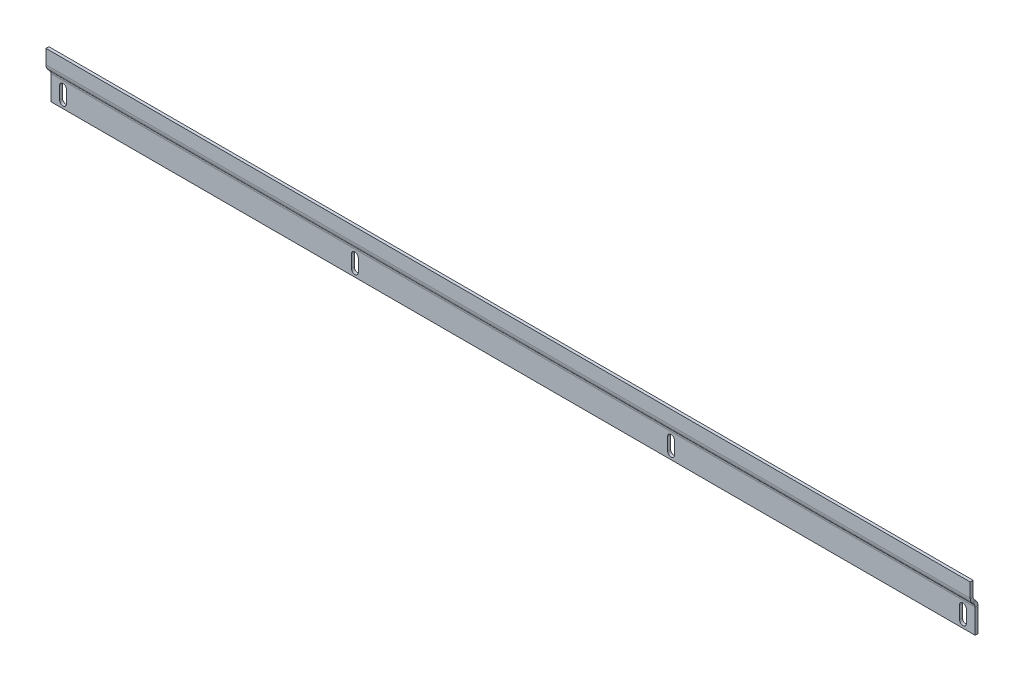
ISO-10303-21;
HEADER;
FILE_DESCRIPTION(('STEP AP214'),'2;1');
FILE_NAME('part.step','',(''),(''),'','','');
FILE_SCHEMA(('AUTOMOTIVE_DESIGN { 1 0 10303 214 1 1 1 1 }'));
ENDSEC;
DATA;
#1=APPLICATION_CONTEXT('core data for automotive mechanical design processes');
#2=APPLICATION_PROTOCOL_DEFINITION('international standard','automotive_design',2000,#1);
#3=PRODUCT_CONTEXT('',#1,'mechanical');
#4=PRODUCT('Part','Part','',(#3));
#5=PRODUCT_RELATED_PRODUCT_CATEGORY('part','',(#4));
#6=PRODUCT_DEFINITION_FORMATION('','',#4);
#7=PRODUCT_DEFINITION_CONTEXT('part definition',#1,'design');
#8=PRODUCT_DEFINITION('design','',#6,#7);
#9=PRODUCT_DEFINITION_SHAPE('','',#8);
#10=(LENGTH_UNIT() NAMED_UNIT(*) SI_UNIT(.MILLI.,.METRE.));
#11=(NAMED_UNIT(*) PLANE_ANGLE_UNIT() SI_UNIT($,.RADIAN.));
#12=(NAMED_UNIT(*) SI_UNIT($,.STERADIAN.) SOLID_ANGLE_UNIT());
#13=UNCERTAINTY_MEASURE_WITH_UNIT(LENGTH_MEASURE(1.E-05),#10,'distance_accuracy_value','');
#14=(GEOMETRIC_REPRESENTATION_CONTEXT(3) GLOBAL_UNCERTAINTY_ASSIGNED_CONTEXT((#13)) GLOBAL_UNIT_ASSIGNED_CONTEXT((#10,
#11,#12)) REPRESENTATION_CONTEXT('',''));
#15=CARTESIAN_POINT('',(0.,0.,0.));
#16=DIRECTION('',(0.,0.,1.));
#17=DIRECTION('',(1.,0.,0.));
#18=AXIS2_PLACEMENT_3D('',#15,#16,#17);
#19=CARTESIAN_POINT('',(-466.,-19.,0.));
#20=DIRECTION('',(1.,0.,0.));
#21=DIRECTION('',(0.,-1.,0.));
#22=AXIS2_PLACEMENT_3D('',#19,#20,#21);
#23=PLANE('',#22);
#24=DIRECTION('',(0.,0.,1.));
#25=VECTOR('',#24,1.);
#26=CARTESIAN_POINT('',(-466.,-19.,0.));
#27=LINE('',#26,#25);
#28=CARTESIAN_POINT('',(-466.,-19.,-3.));
#29=VERTEX_POINT('',#28);
#30=CARTESIAN_POINT('',(-466.,-19.,0.));
#31=VERTEX_POINT('',#30);
#32=EDGE_CURVE('E11',#29,#31,#27,.T.);
#33=ORIENTED_EDGE('',*,*,#32,.F.);
#34=DIRECTION('',(0.,1.,0.));
#35=VECTOR('',#34,1.);
#36=CARTESIAN_POINT('',(-466.,0.,-3.));
#37=LINE('',#36,#35);
#38=CARTESIAN_POINT('',(-466.,-6.00000000000002,-3.));
#39=VERTEX_POINT('',#38);
#40=EDGE_CURVE('E174',#39,#29,#37,.F.);
#41=ORIENTED_EDGE('',*,*,#40,.F.);
#42=DIRECTION('',(0.,0.,1.));
#43=VECTOR('',#42,1.);
#44=CARTESIAN_POINT('',(-466.,-6.00000000000002,0.));
#45=LINE('',#44,#43);
#46=CARTESIAN_POINT('',(-466.,-6.00000000000002,0.));
#47=VERTEX_POINT('',#46);
#48=EDGE_CURVE('E53',#39,#47,#45,.T.);
#49=ORIENTED_EDGE('',*,*,#48,.T.);
#50=DIRECTION('',(0.,-1.,0.));
#51=VECTOR('',#50,1.);
#52=CARTESIAN_POINT('',(-466.,-19.,0.));
#53=LINE('',#52,#51);
#54=EDGE_CURVE('E271',#47,#31,#53,.T.);
#55=ORIENTED_EDGE('',*,*,#54,.T.);
#56=EDGE_LOOP('',(#33,#41,#49,#55));
#57=FACE_BOUND('',#56,.T.);
#58=ADVANCED_FACE('F43',(#57),#23,.T.);
#59=CARTESIAN_POINT('',(-462.5,-6.00000000000002,0.));
#60=DIRECTION('',(0.,0.,-1.));
#61=DIRECTION('',(-1.,0.,0.));
#62=AXIS2_PLACEMENT_3D('',#59,#60,#61);
#63=CYLINDRICAL_SURFACE('',#62,3.5);
#64=ORIENTED_EDGE('',*,*,#48,.F.);
#65=CARTESIAN_POINT('',(-462.5,-6.00000000000002,-3.));
#66=DIRECTION('',(0.,0.,1.));
#67=DIRECTION('',(1.,0.,0.));
#68=AXIS2_PLACEMENT_3D('',#65,#66,#67);
#69=CIRCLE('',#68,3.5);
#70=CARTESIAN_POINT('',(-459.,-6.00000000000002,-3.));
#71=VERTEX_POINT('',#70);
#72=EDGE_CURVE('E191',#71,#39,#69,.T.);
#73=ORIENTED_EDGE('',*,*,#72,.F.);
#74=DIRECTION('',(0.,0.,1.));
#75=VECTOR('',#74,1.);
#76=CARTESIAN_POINT('',(-459.,-6.00000000000002,0.));
#77=LINE('',#76,#75);
#78=CARTESIAN_POINT('',(-459.,-6.00000000000002,0.));
#79=VERTEX_POINT('',#78);
#80=EDGE_CURVE('E165',#71,#79,#77,.T.);
#81=ORIENTED_EDGE('',*,*,#80,.T.);
#82=CARTESIAN_POINT('',(-462.5,-6.00000000000002,0.));
#83=DIRECTION('',(0.,0.,1.));
#84=DIRECTION('',(1.,0.,0.));
#85=AXIS2_PLACEMENT_3D('',#82,#83,#84);
#86=CIRCLE('',#85,3.5);
#87=EDGE_CURVE('E280',#79,#47,#86,.T.);
#88=ORIENTED_EDGE('',*,*,#87,.T.);
#89=EDGE_LOOP('',(#64,#73,#81,#88));
#90=FACE_BOUND('',#89,.T.);
#91=ADVANCED_FACE('F283',(#90),#63,.F.);
#92=CARTESIAN_POINT('',(-459.,-19.,0.));
#93=DIRECTION('',(-1.,0.,0.));
#94=DIRECTION('',(0.,1.,0.));
#95=AXIS2_PLACEMENT_3D('',#92,#93,#94);
#96=PLANE('',#95);
#97=ORIENTED_EDGE('',*,*,#80,.F.);
#98=DIRECTION('',(0.,1.,0.));
#99=VECTOR('',#98,1.);
#100=CARTESIAN_POINT('',(-459.,0.,-3.));
#101=LINE('',#100,#99);
#102=CARTESIAN_POINT('',(-459.,-19.,-3.));
#103=VERTEX_POINT('',#102);
#104=EDGE_CURVE('E172',#103,#71,#101,.T.);
#105=ORIENTED_EDGE('',*,*,#104,.F.);
#106=DIRECTION('',(0.,0.,1.));
#107=VECTOR('',#106,1.);
#108=CARTESIAN_POINT('',(-459.,-19.,0.));
#109=LINE('',#108,#107);
#110=CARTESIAN_POINT('',(-459.,-19.,0.));
#111=VERTEX_POINT('',#110);
#112=EDGE_CURVE('E47',#103,#111,#109,.T.);
#113=ORIENTED_EDGE('',*,*,#112,.T.);
#114=DIRECTION('',(0.,1.,0.));
#115=VECTOR('',#114,1.);
#116=CARTESIAN_POINT('',(-459.,-19.,0.));
#117=LINE('',#116,#115);
#118=EDGE_CURVE('E563',#111,#79,#117,.T.);
#119=ORIENTED_EDGE('',*,*,#118,.T.);
#120=EDGE_LOOP('',(#97,#105,#113,#119));
#121=FACE_BOUND('',#120,.T.);
#122=ADVANCED_FACE('F177',(#121),#96,.T.);
#123=CARTESIAN_POINT('',(459.,-19.,0.));
#124=DIRECTION('',(1.,0.,0.));
#125=DIRECTION('',(0.,-1.,0.));
#126=AXIS2_PLACEMENT_3D('',#123,#124,#125);
#127=PLANE('',#126);
#128=DIRECTION('',(0.,0.,1.));
#129=VECTOR('',#128,1.);
#130=CARTESIAN_POINT('',(459.,-19.,0.));
#131=LINE('',#130,#129);
#132=CARTESIAN_POINT('',(459.,-19.,-3.));
#133=VERTEX_POINT('',#132);
#134=CARTESIAN_POINT('',(459.,-19.,0.));
#135=VERTEX_POINT('',#134);
#136=EDGE_CURVE('E166',#133,#135,#131,.T.);
#137=ORIENTED_EDGE('',*,*,#136,.F.);
#138=DIRECTION('',(0.,1.,0.));
#139=VECTOR('',#138,1.);
#140=CARTESIAN_POINT('',(459.,0.,-3.));
#141=LINE('',#140,#139);
#142=CARTESIAN_POINT('',(459.,-6.00000000000002,-3.));
#143=VERTEX_POINT('',#142);
#144=EDGE_CURVE('E185',#143,#133,#141,.F.);
#145=ORIENTED_EDGE('',*,*,#144,.F.);
#146=DIRECTION('',(0.,0.,1.));
#147=VECTOR('',#146,1.);
#148=CARTESIAN_POINT('',(459.,-6.00000000000002,0.));
#149=LINE('',#148,#147);
#150=CARTESIAN_POINT('',(459.,-6.00000000000002,0.));
#151=VERTEX_POINT('',#150);
#152=EDGE_CURVE('E259',#143,#151,#149,.T.);
#153=ORIENTED_EDGE('',*,*,#152,.T.);
#154=DIRECTION('',(0.,-1.,0.));
#155=VECTOR('',#154,1.);
#156=CARTESIAN_POINT('',(459.,-19.,0.));
#157=LINE('',#156,#155);
#158=EDGE_CURVE('E557',#151,#135,#157,.T.);
#159=ORIENTED_EDGE('',*,*,#158,.T.);
#160=EDGE_LOOP('',(#137,#145,#153,#159));
#161=FACE_BOUND('',#160,.T.);
#162=ADVANCED_FACE('F586',(#161),#127,.T.);
#163=CARTESIAN_POINT('',(462.5,-6.00000000000002,0.));
#164=DIRECTION('',(0.,0.,-1.));
#165=DIRECTION('',(-1.,0.,0.));
#166=AXIS2_PLACEMENT_3D('',#163,#164,#165);
#167=CYLINDRICAL_SURFACE('',#166,3.5);
#168=ORIENTED_EDGE('',*,*,#152,.F.);
#169=CARTESIAN_POINT('',(462.5,-6.00000000000002,-3.));
#170=DIRECTION('',(0.,0.,1.));
#171=DIRECTION('',(1.,0.,0.));
#172=AXIS2_PLACEMENT_3D('',#169,#170,#171);
#173=CIRCLE('',#172,3.5);
#174=CARTESIAN_POINT('',(466.,-6.00000000000002,-3.));
#175=VERTEX_POINT('',#174);
#176=EDGE_CURVE('E180',#175,#143,#173,.T.);
#177=ORIENTED_EDGE('',*,*,#176,.F.);
#178=DIRECTION('',(0.,0.,1.));
#179=VECTOR('',#178,1.);
#180=CARTESIAN_POINT('',(466.,-6.00000000000002,0.));
#181=LINE('',#180,#179);
#182=CARTESIAN_POINT('',(466.,-6.00000000000002,0.));
#183=VERTEX_POINT('',#182);
#184=EDGE_CURVE('E256',#175,#183,#181,.T.);
#185=ORIENTED_EDGE('',*,*,#184,.T.);
#186=CARTESIAN_POINT('',(462.5,-6.00000000000002,0.));
#187=DIRECTION('',(0.,0.,1.));
#188=DIRECTION('',(1.,0.,0.));
#189=AXIS2_PLACEMENT_3D('',#186,#187,#188);
#190=CIRCLE('',#189,3.5);
#191=EDGE_CURVE('E457',#183,#151,#190,.T.);
#192=ORIENTED_EDGE('',*,*,#191,.T.);
#193=EDGE_LOOP('',(#168,#177,#185,#192));
#194=FACE_BOUND('',#193,.T.);
#195=ADVANCED_FACE('F455',(#194),#167,.F.);
#196=CARTESIAN_POINT('',(466.,-19.,0.));
#197=DIRECTION('',(-1.,0.,0.));
#198=DIRECTION('',(0.,1.,0.));
#199=AXIS2_PLACEMENT_3D('',#196,#197,#198);
#200=PLANE('',#199);
#201=ORIENTED_EDGE('',*,*,#184,.F.);
#202=DIRECTION('',(0.,1.,0.));
#203=VECTOR('',#202,1.);
#204=CARTESIAN_POINT('',(466.,0.,-3.));
#205=LINE('',#204,#203);
#206=CARTESIAN_POINT('',(466.,-19.,-3.));
#207=VERTEX_POINT('',#206);
#208=EDGE_CURVE('E423',#207,#175,#205,.T.);
#209=ORIENTED_EDGE('',*,*,#208,.F.);
#210=DIRECTION('',(0.,0.,1.));
#211=VECTOR('',#210,1.);
#212=CARTESIAN_POINT('',(466.,-19.,0.));
#213=LINE('',#212,#211);
#214=CARTESIAN_POINT('',(466.,-19.,0.));
#215=VERTEX_POINT('',#214);
#216=EDGE_CURVE('E253',#207,#215,#213,.T.);
#217=ORIENTED_EDGE('',*,*,#216,.T.);
#218=DIRECTION('',(0.,1.,0.));
#219=VECTOR('',#218,1.);
#220=CARTESIAN_POINT('',(466.,-19.,0.));
#221=LINE('',#220,#219);
#222=EDGE_CURVE('E451',#215,#183,#221,.T.);
#223=ORIENTED_EDGE('',*,*,#222,.T.);
#224=EDGE_LOOP('',(#201,#209,#217,#223));
#225=FACE_BOUND('',#224,.T.);
#226=ADVANCED_FACE('F446',(#225),#200,.T.);
#227=CARTESIAN_POINT('',(159.,-19.,0.));
#228=DIRECTION('',(1.,0.,0.));
#229=DIRECTION('',(0.,-1.,0.));
#230=AXIS2_PLACEMENT_3D('',#227,#228,#229);
#231=PLANE('',#230);
#232=DIRECTION('',(0.,0.,1.));
#233=VECTOR('',#232,1.);
#234=CARTESIAN_POINT('',(159.,-19.,0.));
#235=LINE('',#234,#233);
#236=CARTESIAN_POINT('',(159.,-19.,-3.));
#237=VERTEX_POINT('',#236);
#238=CARTESIAN_POINT('',(159.,-19.,0.));
#239=VERTEX_POINT('',#238);
#240=EDGE_CURVE('E250',#237,#239,#235,.T.);
#241=ORIENTED_EDGE('',*,*,#240,.F.);
#242=DIRECTION('',(0.,1.,0.));
#243=VECTOR('',#242,1.);
#244=CARTESIAN_POINT('',(159.,0.,-3.));
#245=LINE('',#244,#243);
#246=CARTESIAN_POINT('',(159.,-6.00000000000002,-3.));
#247=VERTEX_POINT('',#246);
#248=EDGE_CURVE('E424',#247,#237,#245,.F.);
#249=ORIENTED_EDGE('',*,*,#248,.F.);
#250=DIRECTION('',(0.,0.,1.));
#251=VECTOR('',#250,1.);
#252=CARTESIAN_POINT('',(159.,-6.00000000000002,0.));
#253=LINE('',#252,#251);
#254=CARTESIAN_POINT('',(159.,-6.00000000000002,0.));
#255=VERTEX_POINT('',#254);
#256=EDGE_CURVE('E247',#247,#255,#253,.T.);
#257=ORIENTED_EDGE('',*,*,#256,.T.);
#258=DIRECTION('',(0.,-1.,0.));
#259=VECTOR('',#258,1.);
#260=CARTESIAN_POINT('',(159.,-19.,0.));
#261=LINE('',#260,#259);
#262=EDGE_CURVE('E543',#255,#239,#261,.T.);
#263=ORIENTED_EDGE('',*,*,#262,.T.);
#264=EDGE_LOOP('',(#241,#249,#257,#263));
#265=FACE_BOUND('',#264,.T.);
#266=ADVANCED_FACE('F680',(#265),#231,.T.);
#267=CARTESIAN_POINT('',(162.5,-6.00000000000002,0.));
#268=DIRECTION('',(0.,0.,-1.));
#269=DIRECTION('',(-1.,0.,0.));
#270=AXIS2_PLACEMENT_3D('',#267,#268,#269);
#271=CYLINDRICAL_SURFACE('',#270,3.5);
#272=ORIENTED_EDGE('',*,*,#256,.F.);
#273=CARTESIAN_POINT('',(162.5,-6.00000000000002,-3.));
#274=DIRECTION('',(0.,0.,1.));
#275=DIRECTION('',(1.,0.,0.));
#276=AXIS2_PLACEMENT_3D('',#273,#274,#275);
#277=CIRCLE('',#276,3.5);
#278=CARTESIAN_POINT('',(166.,-6.00000000000002,-3.));
#279=VERTEX_POINT('',#278);
#280=EDGE_CURVE('E419',#279,#247,#277,.T.);
#281=ORIENTED_EDGE('',*,*,#280,.F.);
#282=DIRECTION('',(0.,0.,1.));
#283=VECTOR('',#282,1.);
#284=CARTESIAN_POINT('',(166.,-6.00000000000002,0.));
#285=LINE('',#284,#283);
#286=CARTESIAN_POINT('',(166.,-6.00000000000002,0.));
#287=VERTEX_POINT('',#286);
#288=EDGE_CURVE('E244',#279,#287,#285,.T.);
#289=ORIENTED_EDGE('',*,*,#288,.T.);
#290=CARTESIAN_POINT('',(162.5,-6.00000000000002,0.));
#291=DIRECTION('',(0.,0.,1.));
#292=DIRECTION('',(1.,0.,0.));
#293=AXIS2_PLACEMENT_3D('',#290,#291,#292);
#294=CIRCLE('',#293,3.5);
#295=EDGE_CURVE('E547',#287,#255,#294,.T.);
#296=ORIENTED_EDGE('',*,*,#295,.T.);
#297=EDGE_LOOP('',(#272,#281,#289,#296));
#298=FACE_BOUND('',#297,.T.);
#299=ADVANCED_FACE('F687',(#298),#271,.F.);
#300=CARTESIAN_POINT('',(166.,-19.,0.));
#301=DIRECTION('',(-1.,0.,0.));
#302=DIRECTION('',(0.,1.,0.));
#303=AXIS2_PLACEMENT_3D('',#300,#301,#302);
#304=PLANE('',#303);
#305=ORIENTED_EDGE('',*,*,#288,.F.);
#306=DIRECTION('',(0.,1.,0.));
#307=VECTOR('',#306,1.);
#308=CARTESIAN_POINT('',(166.,0.,-3.));
#309=LINE('',#308,#307);
#310=CARTESIAN_POINT('',(166.,-19.,-3.));
#311=VERTEX_POINT('',#310);
#312=EDGE_CURVE('E407',#311,#279,#309,.T.);
#313=ORIENTED_EDGE('',*,*,#312,.F.);
#314=DIRECTION('',(0.,0.,1.));
#315=VECTOR('',#314,1.);
#316=CARTESIAN_POINT('',(166.,-19.,0.));
#317=LINE('',#316,#315);
#318=CARTESIAN_POINT('',(166.,-19.,0.));
#319=VERTEX_POINT('',#318);
#320=EDGE_CURVE('E241',#311,#319,#317,.T.);
#321=ORIENTED_EDGE('',*,*,#320,.T.);
#322=DIRECTION('',(0.,1.,0.));
#323=VECTOR('',#322,1.);
#324=CARTESIAN_POINT('',(166.,-19.,0.));
#325=LINE('',#324,#323);
#326=EDGE_CURVE('E535',#319,#287,#325,.T.);
#327=ORIENTED_EDGE('',*,*,#326,.T.);
#328=EDGE_LOOP('',(#305,#313,#321,#327));
#329=FACE_BOUND('',#328,.T.);
#330=ADVANCED_FACE('F691',(#329),#304,.T.);
#331=CARTESIAN_POINT('',(-166.,-19.,0.));
#332=DIRECTION('',(1.,0.,0.));
#333=DIRECTION('',(0.,-1.,0.));
#334=AXIS2_PLACEMENT_3D('',#331,#332,#333);
#335=PLANE('',#334);
#336=DIRECTION('',(0.,0.,1.));
#337=VECTOR('',#336,1.);
#338=CARTESIAN_POINT('',(-166.,-19.,0.));
#339=LINE('',#338,#337);
#340=CARTESIAN_POINT('',(-166.,-19.,-3.));
#341=VERTEX_POINT('',#340);
#342=CARTESIAN_POINT('',(-166.,-19.,0.));
#343=VERTEX_POINT('',#342);
#344=EDGE_CURVE('E238',#341,#343,#339,.T.);
#345=ORIENTED_EDGE('',*,*,#344,.F.);
#346=DIRECTION('',(0.,1.,0.));
#347=VECTOR('',#346,1.);
#348=CARTESIAN_POINT('',(-166.,0.,-3.));
#349=LINE('',#348,#347);
#350=CARTESIAN_POINT('',(-166.,-6.00000000000002,-3.));
#351=VERTEX_POINT('',#350);
#352=EDGE_CURVE('E408',#351,#341,#349,.F.);
#353=ORIENTED_EDGE('',*,*,#352,.F.);
#354=DIRECTION('',(0.,0.,1.));
#355=VECTOR('',#354,1.);
#356=CARTESIAN_POINT('',(-166.,-6.00000000000002,0.));
#357=LINE('',#356,#355);
#358=CARTESIAN_POINT('',(-166.,-6.00000000000002,0.));
#359=VERTEX_POINT('',#358);
#360=EDGE_CURVE('E235',#351,#359,#357,.T.);
#361=ORIENTED_EDGE('',*,*,#360,.T.);
#362=DIRECTION('',(0.,-1.,0.));
#363=VECTOR('',#362,1.);
#364=CARTESIAN_POINT('',(-166.,-19.,0.));
#365=LINE('',#364,#363);
#366=EDGE_CURVE('E527',#359,#343,#365,.T.);
#367=ORIENTED_EDGE('',*,*,#366,.T.);
#368=EDGE_LOOP('',(#345,#353,#361,#367));
#369=FACE_BOUND('',#368,.T.);
#370=ADVANCED_FACE('F695',(#369),#335,.T.);
#371=CARTESIAN_POINT('',(-162.5,-6.00000000000002,0.));
#372=DIRECTION('',(0.,0.,-1.));
#373=DIRECTION('',(-1.,0.,0.));
#374=AXIS2_PLACEMENT_3D('',#371,#372,#373);
#375=CYLINDRICAL_SURFACE('',#374,3.5);
#376=ORIENTED_EDGE('',*,*,#360,.F.);
#377=CARTESIAN_POINT('',(-162.5,-6.00000000000002,-3.));
#378=DIRECTION('',(0.,0.,1.));
#379=DIRECTION('',(1.,0.,0.));
#380=AXIS2_PLACEMENT_3D('',#377,#378,#379);
#381=CIRCLE('',#380,3.5);
#382=CARTESIAN_POINT('',(-159.,-6.00000000000002,-3.));
#383=VERTEX_POINT('',#382);
#384=EDGE_CURVE('E403',#383,#351,#381,.T.);
#385=ORIENTED_EDGE('',*,*,#384,.F.);
#386=DIRECTION('',(0.,0.,1.));
#387=VECTOR('',#386,1.);
#388=CARTESIAN_POINT('',(-159.,-6.00000000000002,0.));
#389=LINE('',#388,#387);
#390=CARTESIAN_POINT('',(-159.,-6.00000000000002,0.));
#391=VERTEX_POINT('',#390);
#392=EDGE_CURVE('E232',#383,#391,#389,.T.);
#393=ORIENTED_EDGE('',*,*,#392,.T.);
#394=CARTESIAN_POINT('',(-162.5,-6.00000000000002,0.));
#395=DIRECTION('',(0.,0.,1.));
#396=DIRECTION('',(1.,0.,0.));
#397=AXIS2_PLACEMENT_3D('',#394,#395,#396);
#398=CIRCLE('',#397,3.5);
#399=EDGE_CURVE('E531',#391,#359,#398,.T.);
#400=ORIENTED_EDGE('',*,*,#399,.T.);
#401=EDGE_LOOP('',(#376,#385,#393,#400));
#402=FACE_BOUND('',#401,.T.);
#403=ADVANCED_FACE('F658',(#402),#375,.F.);
#404=CARTESIAN_POINT('',(-159.,-19.,0.));
#405=DIRECTION('',(-1.,0.,0.));
#406=DIRECTION('',(0.,1.,0.));
#407=AXIS2_PLACEMENT_3D('',#404,#405,#406);
#408=PLANE('',#407);
#409=ORIENTED_EDGE('',*,*,#392,.F.);
#410=DIRECTION('',(0.,1.,0.));
#411=VECTOR('',#410,1.);
#412=CARTESIAN_POINT('',(-159.,0.,-3.));
#413=LINE('',#412,#411);
#414=CARTESIAN_POINT('',(-159.,-19.,-3.));
#415=VERTEX_POINT('',#414);
#416=EDGE_CURVE('E364',#415,#383,#413,.T.);
#417=ORIENTED_EDGE('',*,*,#416,.F.);
#418=DIRECTION('',(0.,0.,1.));
#419=VECTOR('',#418,1.);
#420=CARTESIAN_POINT('',(-159.,-19.,0.));
#421=LINE('',#420,#419);
#422=CARTESIAN_POINT('',(-159.,-19.,0.));
#423=VERTEX_POINT('',#422);
#424=EDGE_CURVE('E228',#415,#423,#421,.T.);
#425=ORIENTED_EDGE('',*,*,#424,.T.);
#426=DIRECTION('',(0.,1.,0.));
#427=VECTOR('',#426,1.);
#428=CARTESIAN_POINT('',(-159.,-19.,0.));
#429=LINE('',#428,#427);
#430=EDGE_CURVE('E519',#423,#391,#429,.T.);
#431=ORIENTED_EDGE('',*,*,#430,.T.);
#432=EDGE_LOOP('',(#409,#417,#425,#431));
#433=FACE_BOUND('',#432,.T.);
#434=ADVANCED_FACE('F651',(#433),#408,.T.);
#435=CARTESIAN_POINT('',(-475.,25.,5.00000000000003));
#436=DIRECTION('',(0.,-1.,0.));
#437=DIRECTION('',(-1.,0.,0.));
#438=AXIS2_PLACEMENT_3D('',#435,#436,#437);
#439=PLANE('',#438);
#440=DIRECTION('',(0.,0.,1.));
#441=VECTOR('',#440,1.);
#442=CARTESIAN_POINT('',(475.,25.,5.00000000000003));
#443=LINE('',#442,#441);
#444=CARTESIAN_POINT('',(475.,25.,2.00000000000003));
#445=VERTEX_POINT('',#444);
#446=CARTESIAN_POINT('',(475.,25.,5.00000000000003));
#447=VERTEX_POINT('',#446);
#448=EDGE_CURVE('E226',#445,#447,#443,.T.);
#449=ORIENTED_EDGE('',*,*,#448,.F.);
#450=DIRECTION('',(-1.,0.,0.));
#451=VECTOR('',#450,1.);
#452=CARTESIAN_POINT('',(0.,25.,2.00000000000003));
#453=LINE('',#452,#451);
#454=CARTESIAN_POINT('',(-475.,25.,2.00000000000003));
#455=VERTEX_POINT('',#454);
#456=EDGE_CURVE('E360',#445,#455,#453,.T.);
#457=ORIENTED_EDGE('',*,*,#456,.T.);
#458=DIRECTION('',(0.,0.,1.));
#459=VECTOR('',#458,1.);
#460=CARTESIAN_POINT('',(-475.,25.,5.00000000000003));
#461=LINE('',#460,#459);
#462=CARTESIAN_POINT('',(-475.,25.,5.00000000000003));
#463=VERTEX_POINT('',#462);
#464=EDGE_CURVE('E61',#455,#463,#461,.T.);
#465=ORIENTED_EDGE('',*,*,#464,.T.);
#466=DIRECTION('',(-1.,0.,0.));
#467=VECTOR('',#466,1.);
#468=CARTESIAN_POINT('',(-475.,25.,5.00000000000003));
#469=LINE('',#468,#467);
#470=EDGE_CURVE('E325',#447,#463,#469,.T.);
#471=ORIENTED_EDGE('',*,*,#470,.F.);
#472=EDGE_LOOP('',(#449,#457,#465,#471));
#473=FACE_BOUND('',#472,.T.);
#474=ADVANCED_FACE('F648',(#473),#439,.F.);
#475=CARTESIAN_POINT('',(-475.,-26.5116913143319,5.00000000000003));
#476=DIRECTION('',(1.,0.,0.));
#477=DIRECTION('',(0.,-1.,0.));
#478=AXIS2_PLACEMENT_3D('',#475,#476,#477);
#479=PLANE('',#478);
#480=ORIENTED_EDGE('',*,*,#464,.F.);
#481=DIRECTION('',(0.,1.,0.));
#482=VECTOR('',#481,1.);
#483=CARTESIAN_POINT('',(-475.,-1.51169131433185,2.00000000000003));
#484=LINE('',#483,#482);
#485=CARTESIAN_POINT('',(-475.,10.3847763108503,2.00000000000003));
#486=VERTEX_POINT('',#485);
#487=EDGE_CURVE('E340',#455,#486,#484,.F.);
#488=ORIENTED_EDGE('',*,*,#487,.T.);
#489=DIRECTION('',(0.,0.,1.));
#490=VECTOR('',#489,1.);
#491=CARTESIAN_POINT('',(-475.,10.3847763108503,5.00000000000003));
#492=LINE('',#491,#490);
#493=CARTESIAN_POINT('',(-475.,10.3847763108503,5.00000000000003));
#494=VERTEX_POINT('',#493);
#495=EDGE_CURVE('E222',#486,#494,#492,.T.);
#496=ORIENTED_EDGE('',*,*,#495,.T.);
#497=DIRECTION('',(0.,-1.,0.));
#498=VECTOR('',#497,1.);
#499=CARTESIAN_POINT('',(-475.,-26.5116913143319,5.00000000000003));
#500=LINE('',#499,#498);
#501=EDGE_CURVE('E313',#463,#494,#500,.T.);
#502=ORIENTED_EDGE('',*,*,#501,.F.);
#503=EDGE_LOOP('',(#480,#488,#496,#502));
#504=FACE_BOUND('',#503,.T.);
#505=ADVANCED_FACE('F650',(#504),#479,.F.);
#506=CARTESIAN_POINT('',(-475.,10.3847763108503,-2.99999999999997));
#507=DIRECTION('',(-1.,0.,0.));
#508=DIRECTION('',(0.,0.,1.));
#509=AXIS2_PLACEMENT_3D('',#506,#507,#508);
#510=PLANE('',#509);
#511=ORIENTED_EDGE('',*,*,#495,.F.);
#512=CARTESIAN_POINT('',(-475.,10.3847763108503,-2.99999999999997));
#513=DIRECTION('',(1.,0.,0.));
#514=DIRECTION('',(0.,0.,-1.));
#515=AXIS2_PLACEMENT_3D('',#512,#513,#514);
#516=CIRCLE('',#515,5.);
#517=CARTESIAN_POINT('',(-475.,6.84924240491752,0.535533905932764));
#518=VERTEX_POINT('',#517);
#519=EDGE_CURVE('E359',#518,#486,#516,.F.);
#520=ORIENTED_EDGE('',*,*,#519,.F.);
#521=DIRECTION('',(0.,-0.707106781186549,0.707106781186546));
#522=VECTOR('',#521,1.);
#523=CARTESIAN_POINT('',(-475.,4.72792206135787,2.6568542494924));
#524=LINE('',#523,#522);
#525=CARTESIAN_POINT('',(-475.,4.72792206135787,2.6568542494924));
#526=VERTEX_POINT('',#525);
#527=EDGE_CURVE('E219',#518,#526,#524,.T.);
#528=ORIENTED_EDGE('',*,*,#527,.T.);
#529=CARTESIAN_POINT('',(-475.,10.3847763108503,-2.99999999999997));
#530=DIRECTION('',(1.,0.,0.));
#531=DIRECTION('',(0.,0.,-1.));
#532=AXIS2_PLACEMENT_3D('',#529,#530,#531);
#533=CIRCLE('',#532,8.);
#534=EDGE_CURVE('E231',#526,#494,#533,.F.);
#535=ORIENTED_EDGE('',*,*,#534,.T.);
#536=EDGE_LOOP('',(#511,#520,#528,#535));
#537=FACE_BOUND('',#536,.T.);
#538=ADVANCED_FACE('F494',(#537),#510,.T.);
#539=CARTESIAN_POINT('',(-475.,-17.7519780109846,-19.8230458228502));
#540=DIRECTION('',(1.,0.,0.));
#541=DIRECTION('',(0.,-0.707106781186546,-0.707106781186549));
#542=AXIS2_PLACEMENT_3D('',#539,#540,#541);
#543=PLANE('',#542);
#544=ORIENTED_EDGE('',*,*,#527,.F.);
#545=DIRECTION('',(0.,0.707106781186546,0.707106781186549));
#546=VECTOR('',#545,1.);
#547=CARTESIAN_POINT('',(-475.,2.04701186223871,-4.26669663674605));
#548=LINE('',#547,#546);
#549=CARTESIAN_POINT('',(-475.,5.65685424949238,-0.656854249492379));
#550=VERTEX_POINT('',#549);
#551=EDGE_CURVE('E345',#518,#550,#548,.F.);
#552=ORIENTED_EDGE('',*,*,#551,.T.);
#553=DIRECTION('',(0.,-0.707106781186547,0.707106781186548));
#554=VECTOR('',#553,1.);
#555=CARTESIAN_POINT('',(-475.,3.53553390593273,1.46446609406726));
#556=LINE('',#555,#554);
#557=CARTESIAN_POINT('',(-475.,3.53553390593273,1.46446609406726));
#558=VERTEX_POINT('',#557);
#559=EDGE_CURVE('E216',#550,#558,#556,.T.);
#560=ORIENTED_EDGE('',*,*,#559,.T.);
#561=DIRECTION('',(0.,-0.707106781186546,-0.707106781186549));
#562=VECTOR('',#561,1.);
#563=CARTESIAN_POINT('',(-475.,-17.7519780109846,-19.8230458228502));
#564=LINE('',#563,#562);
#565=EDGE_CURVE('E505',#526,#558,#564,.T.);
#566=ORIENTED_EDGE('',*,*,#565,.F.);
#567=EDGE_LOOP('',(#544,#552,#560,#566));
#568=FACE_BOUND('',#567,.T.);
#569=ADVANCED_FACE('F612',(#568),#543,.F.);
#570=CARTESIAN_POINT('',(-475.,0.,5.));
#571=DIRECTION('',(-1.,0.,0.));
#572=DIRECTION('',(0.,0.,1.));
#573=AXIS2_PLACEMENT_3D('',#570,#571,#572);
#574=PLANE('',#573);
#575=ORIENTED_EDGE('',*,*,#559,.F.);
#576=CARTESIAN_POINT('',(-475.,0.,5.));
#577=DIRECTION('',(1.,0.,0.));
#578=DIRECTION('',(0.,0.,-1.));
#579=AXIS2_PLACEMENT_3D('',#576,#577,#578);
#580=CIRCLE('',#579,8.);
#581=CARTESIAN_POINT('',(-475.,0.,-3.));
#582=VERTEX_POINT('',#581);
#583=EDGE_CURVE('E369',#582,#550,#580,.T.);
#584=ORIENTED_EDGE('',*,*,#583,.F.);
#585=DIRECTION('',(0.,0.,1.));
#586=VECTOR('',#585,1.);
#587=CARTESIAN_POINT('',(-475.,0.,0.));
#588=LINE('',#587,#586);
#589=CARTESIAN_POINT('',(-475.,0.,0.));
#590=VERTEX_POINT('',#589);
#591=EDGE_CURVE('E213',#582,#590,#588,.T.);
#592=ORIENTED_EDGE('',*,*,#591,.T.);
#593=CARTESIAN_POINT('',(-475.,0.,5.));
#594=DIRECTION('',(1.,0.,0.));
#595=DIRECTION('',(0.,0.,-1.));
#596=AXIS2_PLACEMENT_3D('',#593,#594,#595);
#597=CIRCLE('',#596,5.);
#598=EDGE_CURVE('E309',#590,#558,#597,.T.);
#599=ORIENTED_EDGE('',*,*,#598,.T.);
#600=EDGE_LOOP('',(#575,#584,#592,#599));
#601=FACE_BOUND('',#600,.T.);
#602=ADVANCED_FACE('F617',(#601),#574,.T.);
#603=CARTESIAN_POINT('',(-475.,-25.,0.));
#604=DIRECTION('',(1.,0.,0.));
#605=DIRECTION('',(0.,-1.,0.));
#606=AXIS2_PLACEMENT_3D('',#603,#604,#605);
#607=PLANE('',#606);
#608=ORIENTED_EDGE('',*,*,#591,.F.);
#609=DIRECTION('',(0.,1.,0.));
#610=VECTOR('',#609,1.);
#611=CARTESIAN_POINT('',(-475.,0.,-3.));
#612=LINE('',#611,#610);
#613=CARTESIAN_POINT('',(-475.,-25.,-3.));
#614=VERTEX_POINT('',#613);
#615=EDGE_CURVE('E354',#582,#614,#612,.F.);
#616=ORIENTED_EDGE('',*,*,#615,.T.);
#617=DIRECTION('',(0.,0.,1.));
#618=VECTOR('',#617,1.);
#619=CARTESIAN_POINT('',(-475.,-25.,0.));
#620=LINE('',#619,#618);
#621=CARTESIAN_POINT('',(-475.,-25.,0.));
#622=VERTEX_POINT('',#621);
#623=EDGE_CURVE('E210',#614,#622,#620,.T.);
#624=ORIENTED_EDGE('',*,*,#623,.T.);
#625=DIRECTION('',(0.,-1.,0.));
#626=VECTOR('',#625,1.);
#627=CARTESIAN_POINT('',(-475.,-25.,0.));
#628=LINE('',#627,#626);
#629=EDGE_CURVE('E290',#590,#622,#628,.T.);
#630=ORIENTED_EDGE('',*,*,#629,.F.);
#631=EDGE_LOOP('',(#608,#616,#624,#630));
#632=FACE_BOUND('',#631,.T.);
#633=ADVANCED_FACE('F631',(#632),#607,.F.);
#634=CARTESIAN_POINT('',(-475.,-25.,0.));
#635=DIRECTION('',(0.,1.,0.));
#636=DIRECTION('',(1.,0.,0.));
#637=AXIS2_PLACEMENT_3D('',#634,#635,#636);
#638=PLANE('',#637);
#639=ORIENTED_EDGE('',*,*,#623,.F.);
#640=DIRECTION('',(-1.,0.,0.));
#641=VECTOR('',#640,1.);
#642=CARTESIAN_POINT('',(0.,-25.,-3.));
#643=LINE('',#642,#641);
#644=CARTESIAN_POINT('',(475.,-25.,-3.));
#645=VERTEX_POINT('',#644);
#646=EDGE_CURVE('E374',#614,#645,#643,.F.);
#647=ORIENTED_EDGE('',*,*,#646,.T.);
#648=DIRECTION('',(0.,0.,1.));
#649=VECTOR('',#648,1.);
#650=CARTESIAN_POINT('',(475.,-25.,0.));
#651=LINE('',#650,#649);
#652=CARTESIAN_POINT('',(475.,-25.,0.));
#653=VERTEX_POINT('',#652);
#654=EDGE_CURVE('E207',#645,#653,#651,.T.);
#655=ORIENTED_EDGE('',*,*,#654,.T.);
#656=DIRECTION('',(1.,0.,0.));
#657=VECTOR('',#656,1.);
#658=CARTESIAN_POINT('',(-475.,-25.,0.));
#659=LINE('',#658,#657);
#660=EDGE_CURVE('E297',#622,#653,#659,.T.);
#661=ORIENTED_EDGE('',*,*,#660,.F.);
#662=EDGE_LOOP('',(#639,#647,#655,#661));
#663=FACE_BOUND('',#662,.T.);
#664=ADVANCED_FACE('F751',(#663),#638,.F.);
#665=CARTESIAN_POINT('',(475.,-25.,0.));
#666=DIRECTION('',(-1.,0.,0.));
#667=DIRECTION('',(0.,1.,0.));
#668=AXIS2_PLACEMENT_3D('',#665,#666,#667);
#669=PLANE('',#668);
#670=ORIENTED_EDGE('',*,*,#654,.F.);
#671=DIRECTION('',(0.,1.,0.));
#672=VECTOR('',#671,1.);
#673=CARTESIAN_POINT('',(475.,0.,-3.));
#674=LINE('',#673,#672);
#675=CARTESIAN_POINT('',(475.,0.,-3.));
#676=VERTEX_POINT('',#675);
#677=EDGE_CURVE('E370',#645,#676,#674,.T.);
#678=ORIENTED_EDGE('',*,*,#677,.T.);
#679=DIRECTION('',(0.,0.,1.));
#680=VECTOR('',#679,1.);
#681=CARTESIAN_POINT('',(475.,0.,0.));
#682=LINE('',#681,#680);
#683=CARTESIAN_POINT('',(475.,0.,0.));
#684=VERTEX_POINT('',#683);
#685=EDGE_CURVE('E204',#676,#684,#682,.T.);
#686=ORIENTED_EDGE('',*,*,#685,.T.);
#687=DIRECTION('',(0.,1.,0.));
#688=VECTOR('',#687,1.);
#689=CARTESIAN_POINT('',(475.,-25.,0.));
#690=LINE('',#689,#688);
#691=EDGE_CURVE('E301',#653,#684,#690,.T.);
#692=ORIENTED_EDGE('',*,*,#691,.F.);
#693=EDGE_LOOP('',(#670,#678,#686,#692));
#694=FACE_BOUND('',#693,.T.);
#695=ADVANCED_FACE('F744',(#694),#669,.F.);
#696=CARTESIAN_POINT('',(475.,0.,5.));
#697=DIRECTION('',(-1.,0.,0.));
#698=DIRECTION('',(0.,0.,1.));
#699=AXIS2_PLACEMENT_3D('',#696,#697,#698);
#700=PLANE('',#699);
#701=ORIENTED_EDGE('',*,*,#685,.F.);
#702=CARTESIAN_POINT('',(475.,0.,5.));
#703=DIRECTION('',(1.,0.,0.));
#704=DIRECTION('',(0.,0.,-1.));
#705=AXIS2_PLACEMENT_3D('',#702,#703,#704);
#706=CIRCLE('',#705,8.);
#707=CARTESIAN_POINT('',(475.,5.65685424949238,-0.656854249492379));
#708=VERTEX_POINT('',#707);
#709=EDGE_CURVE('E365',#708,#676,#706,.F.);
#710=ORIENTED_EDGE('',*,*,#709,.F.);
#711=DIRECTION('',(0.,-0.707106781186549,0.707106781186546));
#712=VECTOR('',#711,1.);
#713=CARTESIAN_POINT('',(475.,3.53553390593273,1.46446609406726));
#714=LINE('',#713,#712);
#715=CARTESIAN_POINT('',(475.,3.53553390593273,1.46446609406726));
#716=VERTEX_POINT('',#715);
#717=EDGE_CURVE('E200',#708,#716,#714,.T.);
#718=ORIENTED_EDGE('',*,*,#717,.T.);
#719=CARTESIAN_POINT('',(475.,0.,5.));
#720=DIRECTION('',(1.,0.,0.));
#721=DIRECTION('',(0.,0.,-1.));
#722=AXIS2_PLACEMENT_3D('',#719,#720,#721);
#723=CIRCLE('',#722,5.);
#724=EDGE_CURVE('E305',#716,#684,#723,.F.);
#725=ORIENTED_EDGE('',*,*,#724,.T.);
#726=EDGE_LOOP('',(#701,#710,#718,#725));
#727=FACE_BOUND('',#726,.T.);
#728=ADVANCED_FACE('F737',(#727),#700,.F.);
#729=CARTESIAN_POINT('',(475.,-17.7519780109846,-19.8230458228502));
#730=DIRECTION('',(-1.,0.,0.));
#731=DIRECTION('',(0.,0.707106781186546,0.707106781186549));
#732=AXIS2_PLACEMENT_3D('',#729,#730,#731);
#733=PLANE('',#732);
#734=ORIENTED_EDGE('',*,*,#717,.F.);
#735=DIRECTION('',(0.,0.707106781186546,0.707106781186549));
#736=VECTOR('',#735,1.);
#737=CARTESIAN_POINT('',(475.,2.04701186223871,-4.26669663674605));
#738=LINE('',#737,#736);
#739=CARTESIAN_POINT('',(475.,6.84924240491751,0.535533905932761));
#740=VERTEX_POINT('',#739);
#741=EDGE_CURVE('E350',#708,#740,#738,.T.);
#742=ORIENTED_EDGE('',*,*,#741,.T.);
#743=DIRECTION('',(0.,-0.707106781186549,0.707106781186546));
#744=VECTOR('',#743,1.);
#745=CARTESIAN_POINT('',(475.,4.72792206135786,2.6568542494924));
#746=LINE('',#745,#744);
#747=CARTESIAN_POINT('',(475.,4.72792206135786,2.6568542494924));
#748=VERTEX_POINT('',#747);
#749=EDGE_CURVE('E197',#740,#748,#746,.T.);
#750=ORIENTED_EDGE('',*,*,#749,.T.);
#751=DIRECTION('',(0.,0.707106781186546,0.707106781186549));
#752=VECTOR('',#751,1.);
#753=CARTESIAN_POINT('',(475.,-17.7519780109846,-19.8230458228502));
#754=LINE('',#753,#752);
#755=EDGE_CURVE('E507',#716,#748,#754,.T.);
#756=ORIENTED_EDGE('',*,*,#755,.F.);
#757=EDGE_LOOP('',(#734,#742,#750,#756));
#758=FACE_BOUND('',#757,.T.);
#759=ADVANCED_FACE('F639',(#758),#733,.F.);
#760=CARTESIAN_POINT('',(475.,10.3847763108503,-2.99999999999997));
#761=DIRECTION('',(-1.,0.,0.));
#762=DIRECTION('',(0.,0.,1.));
#763=AXIS2_PLACEMENT_3D('',#760,#761,#762);
#764=PLANE('',#763);
#765=ORIENTED_EDGE('',*,*,#749,.F.);
#766=CARTESIAN_POINT('',(475.,10.3847763108503,-2.99999999999997));
#767=DIRECTION('',(1.,0.,0.));
#768=DIRECTION('',(0.,0.,-1.));
#769=AXIS2_PLACEMENT_3D('',#766,#767,#768);
#770=CIRCLE('',#769,5.);
#771=CARTESIAN_POINT('',(475.,10.3847763108503,2.00000000000003));
#772=VERTEX_POINT('',#771);
#773=EDGE_CURVE('E355',#772,#740,#770,.T.);
#774=ORIENTED_EDGE('',*,*,#773,.F.);
#775=DIRECTION('',(0.,0.,1.));
#776=VECTOR('',#775,1.);
#777=CARTESIAN_POINT('',(475.,10.3847763108503,5.00000000000003));
#778=LINE('',#777,#776);
#779=CARTESIAN_POINT('',(475.,10.3847763108503,5.00000000000003));
#780=VERTEX_POINT('',#779);
#781=EDGE_CURVE('E201',#772,#780,#778,.T.);
#782=ORIENTED_EDGE('',*,*,#781,.T.);
#783=CARTESIAN_POINT('',(475.,10.3847763108503,-2.99999999999997));
#784=DIRECTION('',(1.,0.,0.));
#785=DIRECTION('',(0.,0.,-1.));
#786=AXIS2_PLACEMENT_3D('',#783,#784,#785);
#787=CIRCLE('',#786,8.);
#788=EDGE_CURVE('E328',#780,#748,#787,.T.);
#789=ORIENTED_EDGE('',*,*,#788,.T.);
#790=EDGE_LOOP('',(#765,#774,#782,#789));
#791=FACE_BOUND('',#790,.T.);
#792=ADVANCED_FACE('F478',(#791),#764,.F.);
#793=CARTESIAN_POINT('',(-162.5,-19.,0.));
#794=DIRECTION('',(0.,0.,-1.));
#795=DIRECTION('',(-1.,0.,0.));
#796=AXIS2_PLACEMENT_3D('',#793,#794,#795);
#797=CYLINDRICAL_SURFACE('',#796,3.5);
#798=CARTESIAN_POINT('',(-162.5,-19.,-3.));
#799=DIRECTION('',(0.,0.,1.));
#800=DIRECTION('',(1.,0.,0.));
#801=AXIS2_PLACEMENT_3D('',#798,#799,#800);
#802=CIRCLE('',#801,3.5);
#803=EDGE_CURVE('E402',#341,#415,#802,.T.);
#804=ORIENTED_EDGE('',*,*,#803,.F.);
#805=ORIENTED_EDGE('',*,*,#344,.T.);
#806=CARTESIAN_POINT('',(-162.5,-19.,0.));
#807=DIRECTION('',(0.,0.,1.));
#808=DIRECTION('',(1.,0.,0.));
#809=AXIS2_PLACEMENT_3D('',#806,#807,#808);
#810=CIRCLE('',#809,3.5);
#811=EDGE_CURVE('E523',#343,#423,#810,.T.);
#812=ORIENTED_EDGE('',*,*,#811,.T.);
#813=ORIENTED_EDGE('',*,*,#424,.F.);
#814=EDGE_LOOP('',(#804,#805,#812,#813));
#815=FACE_BOUND('',#814,.T.);
#816=ADVANCED_FACE('F683',(#815),#797,.F.);
#817=CARTESIAN_POINT('',(162.5,-19.,0.));
#818=DIRECTION('',(0.,0.,-1.));
#819=DIRECTION('',(-1.,0.,0.));
#820=AXIS2_PLACEMENT_3D('',#817,#818,#819);
#821=CYLINDRICAL_SURFACE('',#820,3.5);
#822=CARTESIAN_POINT('',(162.5,-19.,-3.));
#823=DIRECTION('',(0.,0.,1.));
#824=DIRECTION('',(1.,0.,0.));
#825=AXIS2_PLACEMENT_3D('',#822,#823,#824);
#826=CIRCLE('',#825,3.5);
#827=EDGE_CURVE('E418',#237,#311,#826,.T.);
#828=ORIENTED_EDGE('',*,*,#827,.F.);
#829=ORIENTED_EDGE('',*,*,#240,.T.);
#830=CARTESIAN_POINT('',(162.5,-19.,0.));
#831=DIRECTION('',(0.,0.,1.));
#832=DIRECTION('',(1.,0.,0.));
#833=AXIS2_PLACEMENT_3D('',#830,#831,#832);
#834=CIRCLE('',#833,3.5);
#835=EDGE_CURVE('E539',#239,#319,#834,.T.);
#836=ORIENTED_EDGE('',*,*,#835,.T.);
#837=ORIENTED_EDGE('',*,*,#320,.F.);
#838=EDGE_LOOP('',(#828,#829,#836,#837));
#839=FACE_BOUND('',#838,.T.);
#840=ADVANCED_FACE('F673',(#839),#821,.F.);
#841=CARTESIAN_POINT('',(462.5,-19.,0.));
#842=DIRECTION('',(0.,0.,-1.));
#843=DIRECTION('',(-1.,0.,0.));
#844=AXIS2_PLACEMENT_3D('',#841,#842,#843);
#845=CYLINDRICAL_SURFACE('',#844,3.5);
#846=CARTESIAN_POINT('',(462.5,-19.,-3.));
#847=DIRECTION('',(0.,0.,1.));
#848=DIRECTION('',(1.,0.,0.));
#849=AXIS2_PLACEMENT_3D('',#846,#847,#848);
#850=CIRCLE('',#849,3.5);
#851=EDGE_CURVE('E189',#133,#207,#850,.T.);
#852=ORIENTED_EDGE('',*,*,#851,.F.);
#853=ORIENTED_EDGE('',*,*,#136,.T.);
#854=CARTESIAN_POINT('',(462.5,-19.,0.));
#855=DIRECTION('',(0.,0.,1.));
#856=DIRECTION('',(1.,0.,0.));
#857=AXIS2_PLACEMENT_3D('',#854,#855,#856);
#858=CIRCLE('',#857,3.5);
#859=EDGE_CURVE('E553',#135,#215,#858,.T.);
#860=ORIENTED_EDGE('',*,*,#859,.T.);
#861=ORIENTED_EDGE('',*,*,#216,.F.);
#862=EDGE_LOOP('',(#852,#853,#860,#861));
#863=FACE_BOUND('',#862,.T.);
#864=ADVANCED_FACE('F589',(#863),#845,.F.);
#865=CARTESIAN_POINT('',(-462.5,-19.,0.));
#866=DIRECTION('',(0.,0.,-1.));
#867=DIRECTION('',(-1.,0.,0.));
#868=AXIS2_PLACEMENT_3D('',#865,#866,#867);
#869=CYLINDRICAL_SURFACE('',#868,3.5);
#870=CARTESIAN_POINT('',(-462.5,-19.,-3.));
#871=DIRECTION('',(0.,0.,1.));
#872=DIRECTION('',(1.,0.,0.));
#873=AXIS2_PLACEMENT_3D('',#870,#871,#872);
#874=CIRCLE('',#873,3.5);
#875=EDGE_CURVE('E157',#29,#103,#874,.T.);
#876=ORIENTED_EDGE('',*,*,#875,.F.);
#877=ORIENTED_EDGE('',*,*,#32,.T.);
#878=CARTESIAN_POINT('',(-462.5,-19.,0.));
#879=DIRECTION('',(0.,0.,1.));
#880=DIRECTION('',(1.,0.,0.));
#881=AXIS2_PLACEMENT_3D('',#878,#879,#880);
#882=CIRCLE('',#881,3.5);
#883=EDGE_CURVE('E160',#31,#111,#882,.T.);
#884=ORIENTED_EDGE('',*,*,#883,.T.);
#885=ORIENTED_EDGE('',*,*,#112,.F.);
#886=EDGE_LOOP('',(#876,#877,#884,#885));
#887=FACE_BOUND('',#886,.T.);
#888=ADVANCED_FACE('F45',(#887),#869,.F.);
#889=CARTESIAN_POINT('',(475.,-26.5116913143319,5.00000000000003));
#890=DIRECTION('',(-1.,0.,0.));
#891=DIRECTION('',(0.,1.,0.));
#892=AXIS2_PLACEMENT_3D('',#889,#890,#891);
#893=PLANE('',#892);
#894=DIRECTION('',(0.,1.,0.));
#895=VECTOR('',#894,1.);
#896=CARTESIAN_POINT('',(475.,-1.51169131433185,2.00000000000003));
#897=LINE('',#896,#895);
#898=EDGE_CURVE('E339',#772,#445,#897,.T.);
#899=ORIENTED_EDGE('',*,*,#898,.T.);
#900=ORIENTED_EDGE('',*,*,#448,.T.);
#901=DIRECTION('',(0.,1.,0.));
#902=VECTOR('',#901,1.);
#903=CARTESIAN_POINT('',(475.,-26.5116913143319,5.00000000000003));
#904=LINE('',#903,#902);
#905=EDGE_CURVE('E321',#780,#447,#904,.T.);
#906=ORIENTED_EDGE('',*,*,#905,.F.);
#907=ORIENTED_EDGE('',*,*,#781,.F.);
#908=EDGE_LOOP('',(#899,#900,#906,#907));
#909=FACE_BOUND('',#908,.T.);
#910=ADVANCED_FACE('F488',(#909),#893,.F.);
#911=CARTESIAN_POINT('',(-950.034574345847,10.3847763108503,-2.99999999999997));
#912=DIRECTION('',(1.,0.,0.));
#913=DIRECTION('',(0.,0.,-1.));
#914=AXIS2_PLACEMENT_3D('',#911,#912,#913);
#915=CYLINDRICAL_SURFACE('',#914,8.);
#916=ORIENTED_EDGE('',*,*,#788,.F.);
#917=DIRECTION('',(1.,0.,0.));
#918=VECTOR('',#917,1.);
#919=CARTESIAN_POINT('',(0.,10.3847763108502,5.00000000000003));
#920=LINE('',#919,#918);
#921=EDGE_CURVE('E317',#494,#780,#920,.T.);
#922=ORIENTED_EDGE('',*,*,#921,.F.);
#923=ORIENTED_EDGE('',*,*,#534,.F.);
#924=DIRECTION('',(1.,0.,0.));
#925=VECTOR('',#924,1.);
#926=CARTESIAN_POINT('',(0.,4.72792206135785,2.65685424949239));
#927=LINE('',#926,#925);
#928=EDGE_CURVE('E390',#526,#748,#927,.T.);
#929=ORIENTED_EDGE('',*,*,#928,.T.);
#930=EDGE_LOOP('',(#916,#922,#923,#929));
#931=FACE_BOUND('',#930,.T.);
#932=ADVANCED_FACE('F485',(#931),#915,.T.);
#933=CARTESIAN_POINT('',(0.,-1.51169131433185,5.00000000000003));
#934=DIRECTION('',(0.,0.,-1.));
#935=DIRECTION('',(-1.,0.,0.));
#936=AXIS2_PLACEMENT_3D('',#933,#934,#935);
#937=PLANE('',#936);
#938=ORIENTED_EDGE('',*,*,#501,.T.);
#939=ORIENTED_EDGE('',*,*,#921,.T.);
#940=ORIENTED_EDGE('',*,*,#905,.T.);
#941=ORIENTED_EDGE('',*,*,#470,.T.);
#942=EDGE_LOOP('',(#938,#939,#940,#941));
#943=FACE_BOUND('',#942,.T.);
#944=ADVANCED_FACE('F490',(#943),#937,.F.);
#945=CARTESIAN_POINT('',(-950.018453465048,0.,5.));
#946=DIRECTION('',(1.,0.,0.));
#947=DIRECTION('',(0.,0.,-1.));
#948=AXIS2_PLACEMENT_3D('',#945,#946,#947);
#949=CYLINDRICAL_SURFACE('',#948,5.);
#950=ORIENTED_EDGE('',*,*,#724,.F.);
#951=DIRECTION('',(1.,0.,0.));
#952=VECTOR('',#951,1.);
#953=CARTESIAN_POINT('',(0.,3.53553390593272,1.46446609406725));
#954=LINE('',#953,#952);
#955=EDGE_CURVE('E512',#558,#716,#954,.T.);
#956=ORIENTED_EDGE('',*,*,#955,.F.);
#957=ORIENTED_EDGE('',*,*,#598,.F.);
#958=DIRECTION('',(1.,0.,0.));
#959=VECTOR('',#958,1.);
#960=CARTESIAN_POINT('',(0.,0.,0.));
#961=LINE('',#960,#959);
#962=EDGE_CURVE('E285',#590,#684,#961,.T.);
#963=ORIENTED_EDGE('',*,*,#962,.T.);
#964=EDGE_LOOP('',(#950,#956,#957,#963));
#965=FACE_BOUND('',#964,.T.);
#966=ADVANCED_FACE('F636',(#965),#949,.F.);
#967=CARTESIAN_POINT('',(0.,0.,0.));
#968=DIRECTION('',(0.,0.,-1.));
#969=DIRECTION('',(-1.,0.,0.));
#970=AXIS2_PLACEMENT_3D('',#967,#968,#969);
#971=PLANE('',#970);
#972=ORIENTED_EDGE('',*,*,#430,.F.);
#973=ORIENTED_EDGE('',*,*,#811,.F.);
#974=ORIENTED_EDGE('',*,*,#366,.F.);
#975=ORIENTED_EDGE('',*,*,#399,.F.);
#976=EDGE_LOOP('',(#972,#973,#974,#975));
#977=FACE_BOUND('',#976,.T.);
#978=ORIENTED_EDGE('',*,*,#326,.F.);
#979=ORIENTED_EDGE('',*,*,#835,.F.);
#980=ORIENTED_EDGE('',*,*,#262,.F.);
#981=ORIENTED_EDGE('',*,*,#295,.F.);
#982=EDGE_LOOP('',(#978,#979,#980,#981));
#983=FACE_BOUND('',#982,.T.);
#984=ORIENTED_EDGE('',*,*,#222,.F.);
#985=ORIENTED_EDGE('',*,*,#859,.F.);
#986=ORIENTED_EDGE('',*,*,#158,.F.);
#987=ORIENTED_EDGE('',*,*,#191,.F.);
#988=EDGE_LOOP('',(#984,#985,#986,#987));
#989=FACE_BOUND('',#988,.T.);
#990=ORIENTED_EDGE('',*,*,#118,.F.);
#991=ORIENTED_EDGE('',*,*,#883,.F.);
#992=ORIENTED_EDGE('',*,*,#54,.F.);
#993=ORIENTED_EDGE('',*,*,#87,.F.);
#994=EDGE_LOOP('',(#990,#991,#992,#993));
#995=FACE_BOUND('',#994,.T.);
#996=ORIENTED_EDGE('',*,*,#962,.F.);
#997=ORIENTED_EDGE('',*,*,#629,.T.);
#998=ORIENTED_EDGE('',*,*,#660,.T.);
#999=ORIENTED_EDGE('',*,*,#691,.T.);
#1000=EDGE_LOOP('',(#996,#997,#998,#999));
#1001=FACE_BOUND('',#1000,.T.);
#1002=ADVANCED_FACE('F278',(#977,#983,#989,#995,#1001),#971,.F.);
#1003=CARTESIAN_POINT('',(0.,-0.0743084813209323,-2.14537629318641));
#1004=DIRECTION('',(0.,0.707106781186549,-0.707106781186546));
#1005=DIRECTION('',(-1.,0.,0.));
#1006=AXIS2_PLACEMENT_3D('',#1003,#1004,#1005);
#1007=PLANE('',#1006);
#1008=ORIENTED_EDGE('',*,*,#928,.F.);
#1009=ORIENTED_EDGE('',*,*,#565,.T.);
#1010=ORIENTED_EDGE('',*,*,#955,.T.);
#1011=ORIENTED_EDGE('',*,*,#755,.T.);
#1012=EDGE_LOOP('',(#1008,#1009,#1010,#1011));
#1013=FACE_BOUND('',#1012,.T.);
#1014=ADVANCED_FACE('F503',(#1013),#1007,.F.);
#1015=CARTESIAN_POINT('',(-950.034574345847,10.3847763108503,-2.99999999999997));
#1016=DIRECTION('',(1.,0.,0.));
#1017=DIRECTION('',(0.,0.,-1.));
#1018=AXIS2_PLACEMENT_3D('',#1015,#1016,#1017);
#1019=CYLINDRICAL_SURFACE('',#1018,5.);
#1020=ORIENTED_EDGE('',*,*,#773,.T.);
#1021=DIRECTION('',(1.,0.,0.));
#1022=VECTOR('',#1021,1.);
#1023=CARTESIAN_POINT('',(-950.034574345847,6.84924240491751,0.535533905932756));
#1024=LINE('',#1023,#1022);
#1025=EDGE_CURVE('E341',#518,#740,#1024,.T.);
#1026=ORIENTED_EDGE('',*,*,#1025,.F.);
#1027=ORIENTED_EDGE('',*,*,#519,.T.);
#1028=DIRECTION('',(-1.,0.,0.));
#1029=VECTOR('',#1028,1.);
#1030=CARTESIAN_POINT('',(0.,10.3847763108503,2.00000000000003));
#1031=LINE('',#1030,#1029);
#1032=EDGE_CURVE('E335',#486,#772,#1031,.F.);
#1033=ORIENTED_EDGE('',*,*,#1032,.T.);
#1034=EDGE_LOOP('',(#1020,#1026,#1027,#1033));
#1035=FACE_BOUND('',#1034,.T.);
#1036=ADVANCED_FACE('F642',(#1035),#1019,.F.);
#1037=CARTESIAN_POINT('',(0.,-1.51169131433185,2.00000000000003));
#1038=DIRECTION('',(0.,0.,-1.));
#1039=DIRECTION('',(-1.,0.,0.));
#1040=AXIS2_PLACEMENT_3D('',#1037,#1038,#1039);
#1041=PLANE('',#1040);
#1042=ORIENTED_EDGE('',*,*,#487,.F.);
#1043=ORIENTED_EDGE('',*,*,#456,.F.);
#1044=ORIENTED_EDGE('',*,*,#898,.F.);
#1045=ORIENTED_EDGE('',*,*,#1032,.F.);
#1046=EDGE_LOOP('',(#1042,#1043,#1044,#1045));
#1047=FACE_BOUND('',#1046,.T.);
#1048=ADVANCED_FACE('F647',(#1047),#1041,.T.);
#1049=CARTESIAN_POINT('',(-950.018453465048,0.,5.));
#1050=DIRECTION('',(1.,0.,0.));
#1051=DIRECTION('',(0.,0.,-1.));
#1052=AXIS2_PLACEMENT_3D('',#1049,#1050,#1051);
#1053=CYLINDRICAL_SURFACE('',#1052,8.);
#1054=ORIENTED_EDGE('',*,*,#709,.T.);
#1055=DIRECTION('',(1.,0.,0.));
#1056=VECTOR('',#1055,1.);
#1057=CARTESIAN_POINT('',(-950.018453465048,0.,-3.));
#1058=LINE('',#1057,#1056);
#1059=EDGE_CURVE('E194',#582,#676,#1058,.T.);
#1060=ORIENTED_EDGE('',*,*,#1059,.F.);
#1061=ORIENTED_EDGE('',*,*,#583,.T.);
#1062=DIRECTION('',(-1.,0.,0.));
#1063=VECTOR('',#1062,1.);
#1064=CARTESIAN_POINT('',(0.,5.65685424949238,-0.656854249492379));
#1065=LINE('',#1064,#1063);
#1066=EDGE_CURVE('E346',#550,#708,#1065,.F.);
#1067=ORIENTED_EDGE('',*,*,#1066,.T.);
#1068=EDGE_LOOP('',(#1054,#1060,#1061,#1067));
#1069=FACE_BOUND('',#1068,.T.);
#1070=ADVANCED_FACE('F626',(#1069),#1053,.T.);
#1071=CARTESIAN_POINT('',(0.,0.,-3.));
#1072=DIRECTION('',(0.,0.,-1.));
#1073=DIRECTION('',(-1.,0.,0.));
#1074=AXIS2_PLACEMENT_3D('',#1071,#1072,#1073);
#1075=PLANE('',#1074);
#1076=ORIENTED_EDGE('',*,*,#416,.T.);
#1077=ORIENTED_EDGE('',*,*,#384,.T.);
#1078=ORIENTED_EDGE('',*,*,#352,.T.);
#1079=ORIENTED_EDGE('',*,*,#803,.T.);
#1080=EDGE_LOOP('',(#1076,#1077,#1078,#1079));
#1081=FACE_BOUND('',#1080,.T.);
#1082=ORIENTED_EDGE('',*,*,#312,.T.);
#1083=ORIENTED_EDGE('',*,*,#280,.T.);
#1084=ORIENTED_EDGE('',*,*,#248,.T.);
#1085=ORIENTED_EDGE('',*,*,#827,.T.);
#1086=EDGE_LOOP('',(#1082,#1083,#1084,#1085));
#1087=FACE_BOUND('',#1086,.T.);
#1088=ORIENTED_EDGE('',*,*,#208,.T.);
#1089=ORIENTED_EDGE('',*,*,#176,.T.);
#1090=ORIENTED_EDGE('',*,*,#144,.T.);
#1091=ORIENTED_EDGE('',*,*,#851,.T.);
#1092=EDGE_LOOP('',(#1088,#1089,#1090,#1091));
#1093=FACE_BOUND('',#1092,.T.);
#1094=ORIENTED_EDGE('',*,*,#104,.T.);
#1095=ORIENTED_EDGE('',*,*,#72,.T.);
#1096=ORIENTED_EDGE('',*,*,#40,.T.);
#1097=ORIENTED_EDGE('',*,*,#875,.T.);
#1098=EDGE_LOOP('',(#1094,#1095,#1096,#1097));
#1099=FACE_BOUND('',#1098,.T.);
#1100=ORIENTED_EDGE('',*,*,#1059,.T.);
#1101=ORIENTED_EDGE('',*,*,#677,.F.);
#1102=ORIENTED_EDGE('',*,*,#646,.F.);
#1103=ORIENTED_EDGE('',*,*,#615,.F.);
#1104=EDGE_LOOP('',(#1100,#1101,#1102,#1103));
#1105=FACE_BOUND('',#1104,.T.);
#1106=ADVANCED_FACE('F169',(#1081,#1087,#1093,#1099,#1105),#1075,.T.);
#1107=CARTESIAN_POINT('',(0.,2.04701186223871,-4.26669663674605));
#1108=DIRECTION('',(0.,0.707106781186549,-0.707106781186546));
#1109=DIRECTION('',(-1.,0.,0.));
#1110=AXIS2_PLACEMENT_3D('',#1107,#1108,#1109);
#1111=PLANE('',#1110);
#1112=ORIENTED_EDGE('',*,*,#1025,.T.);
#1113=ORIENTED_EDGE('',*,*,#741,.F.);
#1114=ORIENTED_EDGE('',*,*,#1066,.F.);
#1115=ORIENTED_EDGE('',*,*,#551,.F.);
#1116=EDGE_LOOP('',(#1112,#1113,#1114,#1115));
#1117=FACE_BOUND('',#1116,.T.);
#1118=ADVANCED_FACE('F622',(#1117),#1111,.T.);
#1119=CLOSED_SHELL('',(#58,#91,#122,#162,#195,#226,#266,#299,#330,#370,#403,#434,#474,#505,#538,
#569,#602,#633,#664,#695,#728,#759,#792,#816,#840,#864,#888,#910,#932,#944,#966,#1002,#1014,
#1036,#1048,#1070,#1106,#1118));
#1120=MANIFOLD_SOLID_BREP('B2',#1119);
#1121=ADVANCED_BREP_SHAPE_REPRESENTATION('',(#18,#1120),#14);
#1122=SHAPE_DEFINITION_REPRESENTATION(#9,#1121);
ENDSEC;
END-ISO-10303-21;
